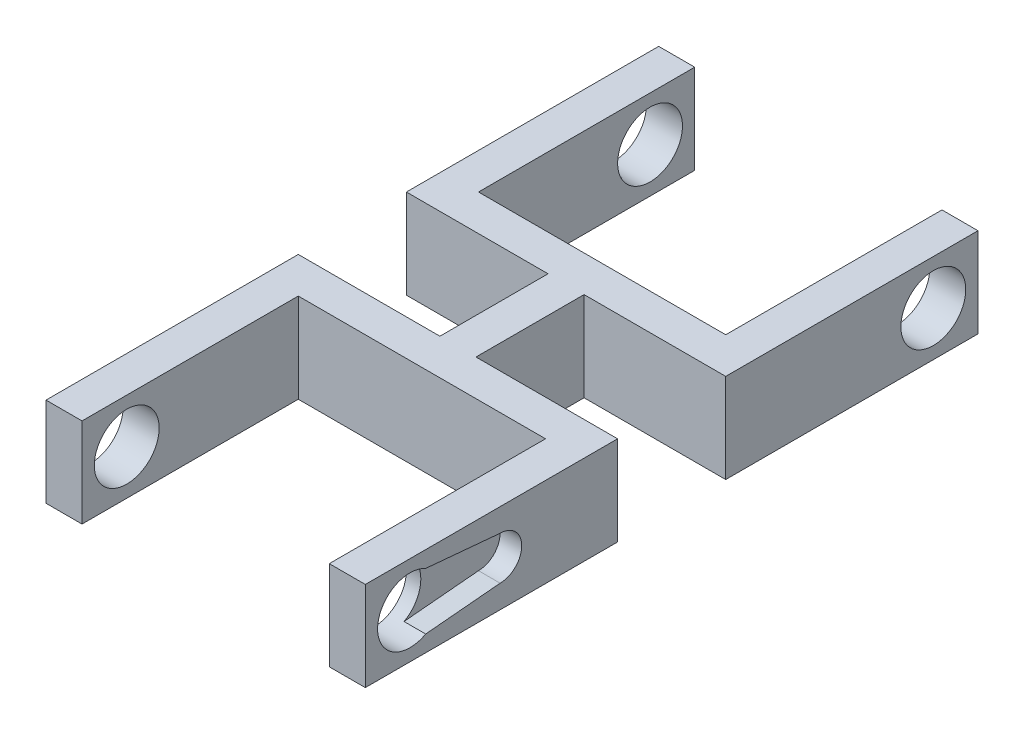
ISO-10303-21;
HEADER;
FILE_DESCRIPTION(('STEP AP214'),'2;1');
FILE_NAME('part.step','',(''),(''),'','','');
FILE_SCHEMA(('AUTOMOTIVE_DESIGN { 1 0 10303 214 1 1 1 1 }'));
ENDSEC;
DATA;
#1=APPLICATION_CONTEXT('core data for automotive mechanical design processes');
#2=APPLICATION_PROTOCOL_DEFINITION('international standard','automotive_design',2000,#1);
#3=PRODUCT_CONTEXT('',#1,'mechanical');
#4=PRODUCT('Part','Part','',(#3));
#5=PRODUCT_RELATED_PRODUCT_CATEGORY('part','',(#4));
#6=PRODUCT_DEFINITION_FORMATION('','',#4);
#7=PRODUCT_DEFINITION_CONTEXT('part definition',#1,'design');
#8=PRODUCT_DEFINITION('design','',#6,#7);
#9=PRODUCT_DEFINITION_SHAPE('','',#8);
#10=(LENGTH_UNIT() NAMED_UNIT(*) SI_UNIT(.MILLI.,.METRE.));
#11=(NAMED_UNIT(*) PLANE_ANGLE_UNIT() SI_UNIT($,.RADIAN.));
#12=(NAMED_UNIT(*) SI_UNIT($,.STERADIAN.) SOLID_ANGLE_UNIT());
#13=UNCERTAINTY_MEASURE_WITH_UNIT(LENGTH_MEASURE(1.E-05),#10,'distance_accuracy_value','');
#14=(GEOMETRIC_REPRESENTATION_CONTEXT(3) GLOBAL_UNCERTAINTY_ASSIGNED_CONTEXT((#13)) GLOBAL_UNIT_ASSIGNED_CONTEXT((#10,
#11,#12)) REPRESENTATION_CONTEXT('',''));
#15=CARTESIAN_POINT('',(0.,0.,0.));
#16=DIRECTION('',(0.,0.,1.));
#17=DIRECTION('',(1.,0.,0.));
#18=AXIS2_PLACEMENT_3D('',#15,#16,#17);
#19=CARTESIAN_POINT('',(0.,0.,-20.));
#20=DIRECTION('',(0.,0.,1.));
#21=DIRECTION('',(1.,0.,0.));
#22=AXIS2_PLACEMENT_3D('',#19,#20,#21);
#23=PLANE('',#22);
#24=DIRECTION('',(0.,-1.,0.));
#25=VECTOR('',#24,1.);
#26=CARTESIAN_POINT('',(-17.15,6.2,-20.));
#27=LINE('',#26,#25);
#28=CARTESIAN_POINT('',(-17.15,6.2,-20.));
#29=VERTEX_POINT('',#28);
#30=CARTESIAN_POINT('',(-17.15,-6.2,-20.));
#31=VERTEX_POINT('',#30);
#32=EDGE_CURVE('E355',#29,#31,#27,.T.);
#33=ORIENTED_EDGE('',*,*,#32,.F.);
#34=DIRECTION('',(1.,0.,0.));
#35=VECTOR('',#34,1.);
#36=CARTESIAN_POINT('',(22.15,6.2,-20.));
#37=LINE('',#36,#35);
#38=CARTESIAN_POINT('',(17.15,6.2,-20.));
#39=VERTEX_POINT('',#38);
#40=EDGE_CURVE('E408',#29,#39,#37,.T.);
#41=ORIENTED_EDGE('',*,*,#40,.T.);
#42=DIRECTION('',(0.,1.,0.));
#43=VECTOR('',#42,1.);
#44=CARTESIAN_POINT('',(17.15,6.2,-20.));
#45=LINE('',#44,#43);
#46=CARTESIAN_POINT('',(17.15,-6.2,-20.));
#47=VERTEX_POINT('',#46);
#48=EDGE_CURVE('E381',#47,#39,#45,.T.);
#49=ORIENTED_EDGE('',*,*,#48,.F.);
#50=DIRECTION('',(-1.,0.,0.));
#51=VECTOR('',#50,1.);
#52=CARTESIAN_POINT('',(22.15,-6.2,-20.));
#53=LINE('',#52,#51);
#54=EDGE_CURVE('E411',#47,#31,#53,.T.);
#55=ORIENTED_EDGE('',*,*,#54,.T.);
#56=EDGE_LOOP('',(#33,#41,#49,#55));
#57=FACE_BOUND('',#56,.T.);
#58=ADVANCED_FACE('F41',(#57),#23,.F.);
#59=CARTESIAN_POINT('',(0.,0.,0.));
#60=DIRECTION('',(0.,0.,1.));
#61=DIRECTION('',(1.,0.,0.));
#62=AXIS2_PLACEMENT_3D('',#59,#60,#61);
#63=PLANE('',#62);
#64=DIRECTION('',(-1.,0.,0.));
#65=VECTOR('',#64,1.);
#66=CARTESIAN_POINT('',(-22.15,6.2,0.));
#67=LINE('',#66,#65);
#68=CARTESIAN_POINT('',(-2.5,6.2,0.));
#69=VERTEX_POINT('',#68);
#70=CARTESIAN_POINT('',(-22.15,6.2,0.));
#71=VERTEX_POINT('',#70);
#72=EDGE_CURVE('E521',#69,#71,#67,.T.);
#73=ORIENTED_EDGE('',*,*,#72,.F.);
#74=DIRECTION('',(0.,1.,0.));
#75=VECTOR('',#74,1.);
#76=CARTESIAN_POINT('',(-2.5,-6.2,0.));
#77=LINE('',#76,#75);
#78=CARTESIAN_POINT('',(-2.5,-6.2,0.));
#79=VERTEX_POINT('',#78);
#80=EDGE_CURVE('E322',#79,#69,#77,.T.);
#81=ORIENTED_EDGE('',*,*,#80,.F.);
#82=DIRECTION('',(1.,0.,0.));
#83=VECTOR('',#82,1.);
#84=CARTESIAN_POINT('',(-22.15,-6.2,0.));
#85=LINE('',#84,#83);
#86=CARTESIAN_POINT('',(-22.15,-6.2,0.));
#87=VERTEX_POINT('',#86);
#88=EDGE_CURVE('E514',#87,#79,#85,.T.);
#89=ORIENTED_EDGE('',*,*,#88,.F.);
#90=DIRECTION('',(0.,-1.,0.));
#91=VECTOR('',#90,1.);
#92=CARTESIAN_POINT('',(-22.15,6.2,0.));
#93=LINE('',#92,#91);
#94=EDGE_CURVE('E525',#71,#87,#93,.T.);
#95=ORIENTED_EDGE('',*,*,#94,.F.);
#96=EDGE_LOOP('',(#73,#81,#89,#95));
#97=FACE_BOUND('',#96,.T.);
#98=ADVANCED_FACE('F569',(#97),#63,.F.);
#99=CARTESIAN_POINT('',(2.49999999999999,-6.2,0.));
#100=VERTEX_POINT('',#99);
#101=CARTESIAN_POINT('',(22.15,-6.2,0.));
#102=VERTEX_POINT('',#101);
#103=EDGE_CURVE('E528',#100,#102,#85,.T.);
#104=ORIENTED_EDGE('',*,*,#103,.F.);
#105=DIRECTION('',(0.,1.,0.));
#106=VECTOR('',#105,1.);
#107=CARTESIAN_POINT('',(2.49999999999999,-6.2,0.));
#108=LINE('',#107,#106);
#109=CARTESIAN_POINT('',(2.49999999999999,6.2,0.));
#110=VERTEX_POINT('',#109);
#111=EDGE_CURVE('E334',#100,#110,#108,.T.);
#112=ORIENTED_EDGE('',*,*,#111,.T.);
#113=CARTESIAN_POINT('',(22.15,6.2,0.));
#114=VERTEX_POINT('',#113);
#115=EDGE_CURVE('E522',#114,#110,#67,.T.);
#116=ORIENTED_EDGE('',*,*,#115,.F.);
#117=DIRECTION('',(0.,1.,0.));
#118=VECTOR('',#117,1.);
#119=CARTESIAN_POINT('',(22.15,6.2,0.));
#120=LINE('',#119,#118);
#121=EDGE_CURVE('E509',#102,#114,#120,.T.);
#122=ORIENTED_EDGE('',*,*,#121,.F.);
#123=EDGE_LOOP('',(#104,#112,#116,#122));
#124=FACE_BOUND('',#123,.T.);
#125=ADVANCED_FACE('F618',(#124),#63,.F.);
#126=CARTESIAN_POINT('',(0.,0.,5.));
#127=DIRECTION('',(0.,0.,1.));
#128=DIRECTION('',(1.,0.,0.));
#129=AXIS2_PLACEMENT_3D('',#126,#127,#128);
#130=PLANE('',#129);
#131=DIRECTION('',(-1.,0.,0.));
#132=VECTOR('',#131,1.);
#133=CARTESIAN_POINT('',(-22.15,6.2,5.));
#134=LINE('',#133,#132);
#135=CARTESIAN_POINT('',(17.15,6.2,5.));
#136=VERTEX_POINT('',#135);
#137=CARTESIAN_POINT('',(-17.15,6.2,5.));
#138=VERTEX_POINT('',#137);
#139=EDGE_CURVE('E510',#136,#138,#134,.T.);
#140=ORIENTED_EDGE('',*,*,#139,.T.);
#141=DIRECTION('',(0.,1.,0.));
#142=VECTOR('',#141,1.);
#143=CARTESIAN_POINT('',(-17.15,6.2,5.));
#144=LINE('',#143,#142);
#145=CARTESIAN_POINT('',(-17.15,-6.2,5.));
#146=VERTEX_POINT('',#145);
#147=EDGE_CURVE('E457',#146,#138,#144,.T.);
#148=ORIENTED_EDGE('',*,*,#147,.F.);
#149=DIRECTION('',(1.,0.,0.));
#150=VECTOR('',#149,1.);
#151=CARTESIAN_POINT('',(-22.15,-6.2,5.));
#152=LINE('',#151,#150);
#153=CARTESIAN_POINT('',(17.15,-6.2,5.));
#154=VERTEX_POINT('',#153);
#155=EDGE_CURVE('E513',#146,#154,#152,.T.);
#156=ORIENTED_EDGE('',*,*,#155,.T.);
#157=DIRECTION('',(0.,-1.,0.));
#158=VECTOR('',#157,1.);
#159=CARTESIAN_POINT('',(17.15,6.2,5.));
#160=LINE('',#159,#158);
#161=EDGE_CURVE('E483',#136,#154,#160,.T.);
#162=ORIENTED_EDGE('',*,*,#161,.F.);
#163=EDGE_LOOP('',(#140,#148,#156,#162));
#164=FACE_BOUND('',#163,.T.);
#165=ADVANCED_FACE('F640',(#164),#130,.T.);
#166=CARTESIAN_POINT('',(22.15,6.2,5.));
#167=DIRECTION('',(-1.,0.,0.));
#168=DIRECTION('',(0.,0.,1.));
#169=AXIS2_PLACEMENT_3D('',#166,#167,#168);
#170=PLANE('',#169);
#171=CARTESIAN_POINT('',(22.15,0.,16.3));
#172=DIRECTION('',(1.,0.,0.));
#173=DIRECTION('',(0.,0.,-1.));
#174=AXIS2_PLACEMENT_3D('',#171,#172,#173);
#175=CIRCLE('',#174,3.);
#176=CARTESIAN_POINT('',(22.15,-3.,16.3));
#177=VERTEX_POINT('',#176);
#178=CARTESIAN_POINT('',(22.15,3.,16.3));
#179=VERTEX_POINT('',#178);
#180=EDGE_CURVE('E236',#177,#179,#175,.T.);
#181=ORIENTED_EDGE('',*,*,#180,.F.);
#182=DIRECTION('',(0.,0.0907148130543785,-0.995876911416521));
#183=VECTOR('',#182,1.);
#184=CARTESIAN_POINT('',(22.15,-3.94071478051588,26.6272673844617));
#185=LINE('',#184,#183);
#186=CARTESIAN_POINT('',(22.15,-3.94071478051588,26.6272673844617));
#187=VERTEX_POINT('',#186);
#188=EDGE_CURVE('E252',#187,#177,#185,.T.);
#189=ORIENTED_EDGE('',*,*,#188,.F.);
#190=CARTESIAN_POINT('',(22.15,0.,28.8));
#191=DIRECTION('',(1.,0.,0.));
#192=DIRECTION('',(0.,0.,-1.));
#193=AXIS2_PLACEMENT_3D('',#190,#191,#192);
#194=CIRCLE('',#193,4.5);
#195=CARTESIAN_POINT('',(22.15,3.94071478051588,26.6272673844617));
#196=VERTEX_POINT('',#195);
#197=EDGE_CURVE('E444',#196,#187,#194,.T.);
#198=ORIENTED_EDGE('',*,*,#197,.F.);
#199=DIRECTION('',(0.,0.0907148130543785,0.995876911416521));
#200=VECTOR('',#199,1.);
#201=CARTESIAN_POINT('',(22.15,3.,16.3));
#202=LINE('',#201,#200);
#203=EDGE_CURVE('E256',#179,#196,#202,.T.);
#204=ORIENTED_EDGE('',*,*,#203,.F.);
#205=EDGE_LOOP('',(#181,#189,#198,#204));
#206=FACE_BOUND('',#205,.T.);
#207=ORIENTED_EDGE('',*,*,#121,.T.);
#208=DIRECTION('',(0.,0.,-1.));
#209=VECTOR('',#208,1.);
#210=CARTESIAN_POINT('',(22.15,6.2,5.));
#211=LINE('',#210,#209);
#212=CARTESIAN_POINT('',(22.15,6.2,35.));
#213=VERTEX_POINT('',#212);
#214=EDGE_CURVE('E11',#213,#114,#211,.T.);
#215=ORIENTED_EDGE('',*,*,#214,.F.);
#216=DIRECTION('',(0.,1.,0.));
#217=VECTOR('',#216,1.);
#218=CARTESIAN_POINT('',(22.15,6.2,35.));
#219=LINE('',#218,#217);
#220=CARTESIAN_POINT('',(22.15,-6.2,35.));
#221=VERTEX_POINT('',#220);
#222=EDGE_CURVE('E484',#221,#213,#219,.T.);
#223=ORIENTED_EDGE('',*,*,#222,.F.);
#224=DIRECTION('',(0.,0.,-1.));
#225=VECTOR('',#224,1.);
#226=CARTESIAN_POINT('',(22.15,-6.2,5.));
#227=LINE('',#226,#225);
#228=EDGE_CURVE('E517',#221,#102,#227,.T.);
#229=ORIENTED_EDGE('',*,*,#228,.T.);
#230=EDGE_LOOP('',(#207,#215,#223,#229));
#231=FACE_BOUND('',#230,.T.);
#232=ADVANCED_FACE('F43',(#206,#231),#170,.F.);
#233=CARTESIAN_POINT('',(-22.15,6.2,5.));
#234=DIRECTION('',(0.,-1.,0.));
#235=DIRECTION('',(0.,0.,-1.));
#236=AXIS2_PLACEMENT_3D('',#233,#234,#235);
#237=PLANE('',#236);
#238=DIRECTION('',(0.,0.,-1.));
#239=VECTOR('',#238,1.);
#240=CARTESIAN_POINT('',(-2.5,6.2,-15.));
#241=LINE('',#240,#239);
#242=CARTESIAN_POINT('',(-2.5,6.2,-15.));
#243=VERTEX_POINT('',#242);
#244=EDGE_CURVE('E317',#69,#243,#241,.T.);
#245=ORIENTED_EDGE('',*,*,#244,.F.);
#246=ORIENTED_EDGE('',*,*,#72,.T.);
#247=DIRECTION('',(0.,0.,-1.));
#248=VECTOR('',#247,1.);
#249=CARTESIAN_POINT('',(-22.15,6.2,5.));
#250=LINE('',#249,#248);
#251=CARTESIAN_POINT('',(-22.15,6.2,35.));
#252=VERTEX_POINT('',#251);
#253=EDGE_CURVE('E51',#252,#71,#250,.T.);
#254=ORIENTED_EDGE('',*,*,#253,.F.);
#255=DIRECTION('',(-1.,0.,0.));
#256=VECTOR('',#255,1.);
#257=CARTESIAN_POINT('',(-22.15,6.2,35.));
#258=LINE('',#257,#256);
#259=CARTESIAN_POINT('',(-17.15,6.2,35.));
#260=VERTEX_POINT('',#259);
#261=EDGE_CURVE('E468',#260,#252,#258,.T.);
#262=ORIENTED_EDGE('',*,*,#261,.F.);
#263=DIRECTION('',(0.,0.,-1.));
#264=VECTOR('',#263,1.);
#265=CARTESIAN_POINT('',(-17.15,6.2,35.));
#266=LINE('',#265,#264);
#267=EDGE_CURVE('E472',#260,#138,#266,.T.);
#268=ORIENTED_EDGE('',*,*,#267,.T.);
#269=ORIENTED_EDGE('',*,*,#139,.F.);
#270=DIRECTION('',(0.,0.,-1.));
#271=VECTOR('',#270,1.);
#272=CARTESIAN_POINT('',(17.15,6.2,35.));
#273=LINE('',#272,#271);
#274=CARTESIAN_POINT('',(17.15,6.2,35.));
#275=VERTEX_POINT('',#274);
#276=EDGE_CURVE('E505',#275,#136,#273,.T.);
#277=ORIENTED_EDGE('',*,*,#276,.F.);
#278=DIRECTION('',(-1.,0.,0.));
#279=VECTOR('',#278,1.);
#280=CARTESIAN_POINT('',(22.15,6.2,35.));
#281=LINE('',#280,#279);
#282=EDGE_CURVE('E488',#213,#275,#281,.T.);
#283=ORIENTED_EDGE('',*,*,#282,.F.);
#284=ORIENTED_EDGE('',*,*,#214,.T.);
#285=ORIENTED_EDGE('',*,*,#115,.T.);
#286=DIRECTION('',(0.,0.,1.));
#287=VECTOR('',#286,1.);
#288=CARTESIAN_POINT('',(2.49999999999999,6.2,-15.));
#289=LINE('',#288,#287);
#290=CARTESIAN_POINT('',(2.49999999999999,6.2,-15.));
#291=VERTEX_POINT('',#290);
#292=EDGE_CURVE('E302',#291,#110,#289,.T.);
#293=ORIENTED_EDGE('',*,*,#292,.F.);
#294=DIRECTION('',(1.,0.,0.));
#295=VECTOR('',#294,1.);
#296=CARTESIAN_POINT('',(22.15,6.2,-15.));
#297=LINE('',#296,#295);
#298=CARTESIAN_POINT('',(22.15,6.2,-15.));
#299=VERTEX_POINT('',#298);
#300=EDGE_CURVE('E419',#291,#299,#297,.T.);
#301=ORIENTED_EDGE('',*,*,#300,.T.);
#302=DIRECTION('',(0.,0.,1.));
#303=VECTOR('',#302,1.);
#304=CARTESIAN_POINT('',(22.15,6.2,-20.));
#305=LINE('',#304,#303);
#306=CARTESIAN_POINT('',(22.15,6.2,-50.));
#307=VERTEX_POINT('',#306);
#308=EDGE_CURVE('E436',#307,#299,#305,.T.);
#309=ORIENTED_EDGE('',*,*,#308,.F.);
#310=DIRECTION('',(1.,0.,0.));
#311=VECTOR('',#310,1.);
#312=CARTESIAN_POINT('',(22.15,6.2,-50.));
#313=LINE('',#312,#311);
#314=CARTESIAN_POINT('',(17.15,6.2,-50.));
#315=VERTEX_POINT('',#314);
#316=EDGE_CURVE('E392',#315,#307,#313,.T.);
#317=ORIENTED_EDGE('',*,*,#316,.F.);
#318=DIRECTION('',(0.,0.,1.));
#319=VECTOR('',#318,1.);
#320=CARTESIAN_POINT('',(17.15,6.2,-50.));
#321=LINE('',#320,#319);
#322=EDGE_CURVE('E396',#315,#39,#321,.T.);
#323=ORIENTED_EDGE('',*,*,#322,.T.);
#324=ORIENTED_EDGE('',*,*,#40,.F.);
#325=DIRECTION('',(0.,0.,1.));
#326=VECTOR('',#325,1.);
#327=CARTESIAN_POINT('',(-17.15,6.2,-50.));
#328=LINE('',#327,#326);
#329=CARTESIAN_POINT('',(-17.15,6.2,-50.));
#330=VERTEX_POINT('',#329);
#331=EDGE_CURVE('E377',#330,#29,#328,.T.);
#332=ORIENTED_EDGE('',*,*,#331,.F.);
#333=DIRECTION('',(1.,0.,0.));
#334=VECTOR('',#333,1.);
#335=CARTESIAN_POINT('',(-22.15,6.2,-50.));
#336=LINE('',#335,#334);
#337=CARTESIAN_POINT('',(-22.15,6.2,-50.));
#338=VERTEX_POINT('',#337);
#339=EDGE_CURVE('E360',#338,#330,#336,.T.);
#340=ORIENTED_EDGE('',*,*,#339,.F.);
#341=DIRECTION('',(0.,0.,1.));
#342=VECTOR('',#341,1.);
#343=CARTESIAN_POINT('',(-22.15,6.2,-20.));
#344=LINE('',#343,#342);
#345=CARTESIAN_POINT('',(-22.15,6.2,-15.));
#346=VERTEX_POINT('',#345);
#347=EDGE_CURVE('E440',#338,#346,#344,.T.);
#348=ORIENTED_EDGE('',*,*,#347,.T.);
#349=EDGE_CURVE('E420',#346,#243,#297,.T.);
#350=ORIENTED_EDGE('',*,*,#349,.T.);
#351=EDGE_LOOP('',(#245,#246,#254,#262,#268,#269,#277,#283,#284,#285,#293,#301,#309,#317,#323,
#324,#332,#340,#348,#350));
#352=FACE_BOUND('',#351,.T.);
#353=ADVANCED_FACE('F559',(#352),#237,.F.);
#354=CARTESIAN_POINT('',(-22.15,6.2,5.));
#355=DIRECTION('',(1.,0.,0.));
#356=DIRECTION('',(0.,1.,0.));
#357=AXIS2_PLACEMENT_3D('',#354,#355,#356);
#358=PLANE('',#357);
#359=CARTESIAN_POINT('',(-22.15,0.,28.8));
#360=DIRECTION('',(1.,0.,0.));
#361=DIRECTION('',(0.,1.,0.));
#362=AXIS2_PLACEMENT_3D('',#359,#360,#361);
#363=CIRCLE('',#362,4.5);
#364=CARTESIAN_POINT('',(-22.15,4.5,28.8));
#365=VERTEX_POINT('',#364);
#366=EDGE_CURVE('E453',#365,#365,#363,.T.);
#367=ORIENTED_EDGE('',*,*,#366,.T.);
#368=EDGE_LOOP('',(#367));
#369=FACE_BOUND('',#368,.T.);
#370=ORIENTED_EDGE('',*,*,#94,.T.);
#371=DIRECTION('',(0.,0.,-1.));
#372=VECTOR('',#371,1.);
#373=CARTESIAN_POINT('',(-22.15,-6.2,5.));
#374=LINE('',#373,#372);
#375=CARTESIAN_POINT('',(-22.15,-6.2,35.));
#376=VERTEX_POINT('',#375);
#377=EDGE_CURVE('E534',#376,#87,#374,.T.);
#378=ORIENTED_EDGE('',*,*,#377,.F.);
#379=DIRECTION('',(0.,-1.,0.));
#380=VECTOR('',#379,1.);
#381=CARTESIAN_POINT('',(-22.15,6.2,35.));
#382=LINE('',#381,#380);
#383=EDGE_CURVE('E458',#252,#376,#382,.T.);
#384=ORIENTED_EDGE('',*,*,#383,.F.);
#385=ORIENTED_EDGE('',*,*,#253,.T.);
#386=EDGE_LOOP('',(#370,#378,#384,#385));
#387=FACE_BOUND('',#386,.T.);
#388=ADVANCED_FACE('F555',(#369,#387),#358,.F.);
#389=CARTESIAN_POINT('',(-22.15,-6.2,5.));
#390=DIRECTION('',(0.,1.,0.));
#391=DIRECTION('',(0.,0.,1.));
#392=AXIS2_PLACEMENT_3D('',#389,#390,#391);
#393=PLANE('',#392);
#394=ORIENTED_EDGE('',*,*,#88,.T.);
#395=DIRECTION('',(0.,0.,-1.));
#396=VECTOR('',#395,1.);
#397=CARTESIAN_POINT('',(-2.5,-6.2,-15.));
#398=LINE('',#397,#396);
#399=CARTESIAN_POINT('',(-2.5,-6.2,-15.));
#400=VERTEX_POINT('',#399);
#401=EDGE_CURVE('E312',#79,#400,#398,.T.);
#402=ORIENTED_EDGE('',*,*,#401,.T.);
#403=DIRECTION('',(-1.,0.,0.));
#404=VECTOR('',#403,1.);
#405=CARTESIAN_POINT('',(22.15,-6.2,-15.));
#406=LINE('',#405,#404);
#407=CARTESIAN_POINT('',(-22.15,-6.2,-15.));
#408=VERTEX_POINT('',#407);
#409=EDGE_CURVE('E426',#400,#408,#406,.T.);
#410=ORIENTED_EDGE('',*,*,#409,.T.);
#411=DIRECTION('',(0.,0.,1.));
#412=VECTOR('',#411,1.);
#413=CARTESIAN_POINT('',(-22.15,-6.2,-20.));
#414=LINE('',#413,#412);
#415=CARTESIAN_POINT('',(-22.15,-6.2,-50.));
#416=VERTEX_POINT('',#415);
#417=EDGE_CURVE('E415',#416,#408,#414,.T.);
#418=ORIENTED_EDGE('',*,*,#417,.F.);
#419=DIRECTION('',(-1.,0.,0.));
#420=VECTOR('',#419,1.);
#421=CARTESIAN_POINT('',(-22.15,-6.2,-50.));
#422=LINE('',#421,#420);
#423=CARTESIAN_POINT('',(-17.15,-6.2,-50.));
#424=VERTEX_POINT('',#423);
#425=EDGE_CURVE('E366',#424,#416,#422,.T.);
#426=ORIENTED_EDGE('',*,*,#425,.F.);
#427=DIRECTION('',(0.,0.,1.));
#428=VECTOR('',#427,1.);
#429=CARTESIAN_POINT('',(-17.15,-6.2,-50.));
#430=LINE('',#429,#428);
#431=EDGE_CURVE('E370',#424,#31,#430,.T.);
#432=ORIENTED_EDGE('',*,*,#431,.T.);
#433=ORIENTED_EDGE('',*,*,#54,.F.);
#434=DIRECTION('',(0.,0.,1.));
#435=VECTOR('',#434,1.);
#436=CARTESIAN_POINT('',(17.15,-6.2,-50.));
#437=LINE('',#436,#435);
#438=CARTESIAN_POINT('',(17.15,-6.2,-50.));
#439=VERTEX_POINT('',#438);
#440=EDGE_CURVE('E403',#439,#47,#437,.T.);
#441=ORIENTED_EDGE('',*,*,#440,.F.);
#442=DIRECTION('',(-1.,0.,0.));
#443=VECTOR('',#442,1.);
#444=CARTESIAN_POINT('',(22.15,-6.2,-50.));
#445=LINE('',#444,#443);
#446=CARTESIAN_POINT('',(22.15,-6.2,-50.));
#447=VERTEX_POINT('',#446);
#448=EDGE_CURVE('E386',#447,#439,#445,.T.);
#449=ORIENTED_EDGE('',*,*,#448,.F.);
#450=DIRECTION('',(0.,0.,1.));
#451=VECTOR('',#450,1.);
#452=CARTESIAN_POINT('',(22.15,-6.2,-20.));
#453=LINE('',#452,#451);
#454=CARTESIAN_POINT('',(22.15,-6.2,-15.));
#455=VERTEX_POINT('',#454);
#456=EDGE_CURVE('E432',#447,#455,#453,.T.);
#457=ORIENTED_EDGE('',*,*,#456,.T.);
#458=CARTESIAN_POINT('',(2.49999999999999,-6.2,-15.));
#459=VERTEX_POINT('',#458);
#460=EDGE_CURVE('E412',#455,#459,#406,.T.);
#461=ORIENTED_EDGE('',*,*,#460,.T.);
#462=DIRECTION('',(0.,0.,1.));
#463=VECTOR('',#462,1.);
#464=CARTESIAN_POINT('',(2.49999999999999,-6.2,-15.));
#465=LINE('',#464,#463);
#466=EDGE_CURVE('E330',#459,#100,#465,.T.);
#467=ORIENTED_EDGE('',*,*,#466,.T.);
#468=ORIENTED_EDGE('',*,*,#103,.T.);
#469=ORIENTED_EDGE('',*,*,#228,.F.);
#470=DIRECTION('',(1.,0.,0.));
#471=VECTOR('',#470,1.);
#472=CARTESIAN_POINT('',(22.15,-6.2,35.));
#473=LINE('',#472,#471);
#474=CARTESIAN_POINT('',(17.15,-6.2,35.));
#475=VERTEX_POINT('',#474);
#476=EDGE_CURVE('E494',#475,#221,#473,.T.);
#477=ORIENTED_EDGE('',*,*,#476,.F.);
#478=DIRECTION('',(0.,0.,-1.));
#479=VECTOR('',#478,1.);
#480=CARTESIAN_POINT('',(17.15,-6.2,35.));
#481=LINE('',#480,#479);
#482=EDGE_CURVE('E498',#475,#154,#481,.T.);
#483=ORIENTED_EDGE('',*,*,#482,.T.);
#484=ORIENTED_EDGE('',*,*,#155,.F.);
#485=DIRECTION('',(0.,0.,-1.));
#486=VECTOR('',#485,1.);
#487=CARTESIAN_POINT('',(-17.15,-6.2,35.));
#488=LINE('',#487,#486);
#489=CARTESIAN_POINT('',(-17.15,-6.2,35.));
#490=VERTEX_POINT('',#489);
#491=EDGE_CURVE('E479',#490,#146,#488,.T.);
#492=ORIENTED_EDGE('',*,*,#491,.F.);
#493=DIRECTION('',(1.,0.,0.));
#494=VECTOR('',#493,1.);
#495=CARTESIAN_POINT('',(-22.15,-6.2,35.));
#496=LINE('',#495,#494);
#497=EDGE_CURVE('E462',#376,#490,#496,.T.);
#498=ORIENTED_EDGE('',*,*,#497,.F.);
#499=ORIENTED_EDGE('',*,*,#377,.T.);
#500=EDGE_LOOP('',(#394,#402,#410,#418,#426,#432,#433,#441,#449,#457,#461,#467,#468,#469,#477,
#483,#484,#492,#498,#499));
#501=FACE_BOUND('',#500,.T.);
#502=ADVANCED_FACE('F558',(#501),#393,.F.);
#503=CARTESIAN_POINT('',(17.15,6.2,35.));
#504=DIRECTION('',(1.,0.,0.));
#505=DIRECTION('',(0.,0.,-1.));
#506=AXIS2_PLACEMENT_3D('',#503,#504,#505);
#507=PLANE('',#506);
#508=CARTESIAN_POINT('',(17.15,0.,28.8));
#509=DIRECTION('',(1.,0.,0.));
#510=DIRECTION('',(0.,0.,-1.));
#511=AXIS2_PLACEMENT_3D('',#508,#509,#510);
#512=CIRCLE('',#511,4.5);
#513=CARTESIAN_POINT('',(17.15,0.,24.3));
#514=VERTEX_POINT('',#513);
#515=EDGE_CURVE('E449',#514,#514,#512,.T.);
#516=ORIENTED_EDGE('',*,*,#515,.T.);
#517=EDGE_LOOP('',(#516));
#518=FACE_BOUND('',#517,.T.);
#519=ORIENTED_EDGE('',*,*,#161,.T.);
#520=ORIENTED_EDGE('',*,*,#482,.F.);
#521=DIRECTION('',(0.,-1.,0.));
#522=VECTOR('',#521,1.);
#523=CARTESIAN_POINT('',(17.15,6.2,35.));
#524=LINE('',#523,#522);
#525=EDGE_CURVE('E491',#275,#475,#524,.T.);
#526=ORIENTED_EDGE('',*,*,#525,.F.);
#527=ORIENTED_EDGE('',*,*,#276,.T.);
#528=EDGE_LOOP('',(#519,#520,#526,#527));
#529=FACE_BOUND('',#528,.T.);
#530=ADVANCED_FACE('F632',(#518,#529),#507,.F.);
#531=CARTESIAN_POINT('',(0.,0.,35.));
#532=DIRECTION('',(0.,0.,-1.));
#533=DIRECTION('',(-1.,0.,0.));
#534=AXIS2_PLACEMENT_3D('',#531,#532,#533);
#535=PLANE('',#534);
#536=ORIENTED_EDGE('',*,*,#222,.T.);
#537=ORIENTED_EDGE('',*,*,#282,.T.);
#538=ORIENTED_EDGE('',*,*,#525,.T.);
#539=ORIENTED_EDGE('',*,*,#476,.T.);
#540=EDGE_LOOP('',(#536,#537,#538,#539));
#541=FACE_BOUND('',#540,.T.);
#542=ADVANCED_FACE('F636',(#541),#535,.F.);
#543=CARTESIAN_POINT('',(-17.15,6.2,35.));
#544=DIRECTION('',(-1.,0.,0.));
#545=DIRECTION('',(0.,0.,1.));
#546=AXIS2_PLACEMENT_3D('',#543,#544,#545);
#547=PLANE('',#546);
#548=CARTESIAN_POINT('',(-17.15,0.,28.8));
#549=DIRECTION('',(-1.,0.,0.));
#550=DIRECTION('',(0.,0.,1.));
#551=AXIS2_PLACEMENT_3D('',#548,#549,#550);
#552=CIRCLE('',#551,4.5);
#553=CARTESIAN_POINT('',(-17.15,0.,33.3));
#554=VERTEX_POINT('',#553);
#555=EDGE_CURVE('E448',#554,#554,#552,.T.);
#556=ORIENTED_EDGE('',*,*,#555,.T.);
#557=EDGE_LOOP('',(#556));
#558=FACE_BOUND('',#557,.T.);
#559=ORIENTED_EDGE('',*,*,#147,.T.);
#560=ORIENTED_EDGE('',*,*,#267,.F.);
#561=DIRECTION('',(0.,1.,0.));
#562=VECTOR('',#561,1.);
#563=CARTESIAN_POINT('',(-17.15,6.2,35.));
#564=LINE('',#563,#562);
#565=EDGE_CURVE('E465',#490,#260,#564,.T.);
#566=ORIENTED_EDGE('',*,*,#565,.F.);
#567=ORIENTED_EDGE('',*,*,#491,.T.);
#568=EDGE_LOOP('',(#559,#560,#566,#567));
#569=FACE_BOUND('',#568,.T.);
#570=ADVANCED_FACE('F544',(#558,#569),#547,.F.);
#571=CARTESIAN_POINT('',(0.,0.,35.));
#572=DIRECTION('',(0.,0.,1.));
#573=DIRECTION('',(1.,0.,0.));
#574=AXIS2_PLACEMENT_3D('',#571,#572,#573);
#575=PLANE('',#574);
#576=ORIENTED_EDGE('',*,*,#383,.T.);
#577=ORIENTED_EDGE('',*,*,#497,.T.);
#578=ORIENTED_EDGE('',*,*,#565,.T.);
#579=ORIENTED_EDGE('',*,*,#261,.T.);
#580=EDGE_LOOP('',(#576,#577,#578,#579));
#581=FACE_BOUND('',#580,.T.);
#582=ADVANCED_FACE('F551',(#581),#575,.T.);
#583=CARTESIAN_POINT('',(-27.85,0.,28.8));
#584=DIRECTION('',(1.,0.,0.));
#585=DIRECTION('',(0.,0.,-1.));
#586=AXIS2_PLACEMENT_3D('',#583,#584,#585);
#587=CYLINDRICAL_SURFACE('',#586,4.5);
#588=ORIENTED_EDGE('',*,*,#555,.F.);
#589=EDGE_LOOP('',(#588));
#590=FACE_BOUND('',#589,.T.);
#591=ORIENTED_EDGE('',*,*,#366,.F.);
#592=EDGE_LOOP('',(#591));
#593=FACE_BOUND('',#592,.T.);
#594=ADVANCED_FACE('F547',(#590,#593),#587,.F.);
#595=ORIENTED_EDGE('',*,*,#197,.T.);
#596=DIRECTION('',(1.,0.,0.));
#597=VECTOR('',#596,1.);
#598=CARTESIAN_POINT('',(19.15,-3.94071478051588,26.6272673844617));
#599=LINE('',#598,#597);
#600=CARTESIAN_POINT('',(19.15,-3.94071478051588,26.6272673844617));
#601=VERTEX_POINT('',#600);
#602=EDGE_CURVE('E271',#601,#187,#599,.T.);
#603=ORIENTED_EDGE('',*,*,#602,.F.);
#604=CARTESIAN_POINT('',(19.15,0.,28.8));
#605=DIRECTION('',(-1.,0.,0.));
#606=DIRECTION('',(0.,0.,1.));
#607=AXIS2_PLACEMENT_3D('',#604,#605,#606);
#608=CIRCLE('',#607,4.5);
#609=CARTESIAN_POINT('',(19.15,3.94071478051588,26.6272673844617));
#610=VERTEX_POINT('',#609);
#611=EDGE_CURVE('E247',#610,#601,#608,.T.);
#612=ORIENTED_EDGE('',*,*,#611,.F.);
#613=DIRECTION('',(1.,0.,0.));
#614=VECTOR('',#613,1.);
#615=CARTESIAN_POINT('',(19.15,3.94071478051588,26.6272673844617));
#616=LINE('',#615,#614);
#617=EDGE_CURVE('E240',#610,#196,#616,.T.);
#618=ORIENTED_EDGE('',*,*,#617,.T.);
#619=EDGE_LOOP('',(#595,#603,#612,#618));
#620=FACE_BOUND('',#619,.T.);
#621=ORIENTED_EDGE('',*,*,#515,.F.);
#622=EDGE_LOOP('',(#621));
#623=FACE_BOUND('',#622,.T.);
#624=ADVANCED_FACE('F550',(#620,#623),#587,.F.);
#625=CARTESIAN_POINT('',(0.,0.,-15.));
#626=DIRECTION('',(0.,0.,1.));
#627=DIRECTION('',(1.,0.,0.));
#628=AXIS2_PLACEMENT_3D('',#625,#626,#627);
#629=PLANE('',#628);
#630=ORIENTED_EDGE('',*,*,#409,.F.);
#631=DIRECTION('',(0.,1.,0.));
#632=VECTOR('',#631,1.);
#633=CARTESIAN_POINT('',(-2.5,-6.2,-15.));
#634=LINE('',#633,#632);
#635=EDGE_CURVE('E316',#400,#243,#634,.T.);
#636=ORIENTED_EDGE('',*,*,#635,.T.);
#637=ORIENTED_EDGE('',*,*,#349,.F.);
#638=DIRECTION('',(0.,1.,0.));
#639=VECTOR('',#638,1.);
#640=CARTESIAN_POINT('',(-22.15,-6.2,-15.));
#641=LINE('',#640,#639);
#642=EDGE_CURVE('E407',#408,#346,#641,.T.);
#643=ORIENTED_EDGE('',*,*,#642,.F.);
#644=EDGE_LOOP('',(#630,#636,#637,#643));
#645=FACE_BOUND('',#644,.T.);
#646=ADVANCED_FACE('F582',(#645),#629,.T.);
#647=CARTESIAN_POINT('',(-22.15,-6.2,-20.));
#648=DIRECTION('',(1.,0.,0.));
#649=DIRECTION('',(0.,0.,-1.));
#650=AXIS2_PLACEMENT_3D('',#647,#648,#649);
#651=PLANE('',#650);
#652=CARTESIAN_POINT('',(-22.15,0.,-31.3));
#653=DIRECTION('',(-1.,0.,0.));
#654=DIRECTION('',(0.,0.,1.));
#655=AXIS2_PLACEMENT_3D('',#652,#653,#654);
#656=CIRCLE('',#655,2.99999999999999);
#657=CARTESIAN_POINT('',(-22.15,-2.99999999999999,-31.3));
#658=VERTEX_POINT('',#657);
#659=CARTESIAN_POINT('',(-22.15,2.99999999999999,-31.3));
#660=VERTEX_POINT('',#659);
#661=EDGE_CURVE('E270',#658,#660,#656,.T.);
#662=ORIENTED_EDGE('',*,*,#661,.F.);
#663=DIRECTION('',(0.,0.104998471364696,0.994472383231972));
#664=VECTOR('',#663,1.);
#665=CARTESIAN_POINT('',(-22.15,-4.13146733282698,-42.0164704438156));
#666=LINE('',#665,#664);
#667=CARTESIAN_POINT('',(-22.15,-4.13146733282698,-42.0164704438156));
#668=VERTEX_POINT('',#667);
#669=EDGE_CURVE('E279',#668,#658,#666,.T.);
#670=ORIENTED_EDGE('',*,*,#669,.F.);
#671=CARTESIAN_POINT('',(-22.15,0.,-43.8));
#672=DIRECTION('',(-1.,0.,0.));
#673=DIRECTION('',(0.,0.,1.));
#674=AXIS2_PLACEMENT_3D('',#671,#672,#673);
#675=CIRCLE('',#674,4.5);
#676=CARTESIAN_POINT('',(-22.15,4.13146733282699,-42.0164704438156));
#677=VERTEX_POINT('',#676);
#678=EDGE_CURVE('E326',#677,#668,#675,.T.);
#679=ORIENTED_EDGE('',*,*,#678,.F.);
#680=DIRECTION('',(0.,0.104998471364696,-0.994472383231972));
#681=VECTOR('',#680,1.);
#682=CARTESIAN_POINT('',(-22.15,2.99999999999999,-31.3));
#683=LINE('',#682,#681);
#684=EDGE_CURVE('E293',#660,#677,#683,.T.);
#685=ORIENTED_EDGE('',*,*,#684,.F.);
#686=EDGE_LOOP('',(#662,#670,#679,#685));
#687=FACE_BOUND('',#686,.T.);
#688=ORIENTED_EDGE('',*,*,#642,.T.);
#689=ORIENTED_EDGE('',*,*,#347,.F.);
#690=DIRECTION('',(0.,1.,0.));
#691=VECTOR('',#690,1.);
#692=CARTESIAN_POINT('',(-22.15,6.2,-50.));
#693=LINE('',#692,#691);
#694=EDGE_CURVE('E356',#416,#338,#693,.T.);
#695=ORIENTED_EDGE('',*,*,#694,.F.);
#696=ORIENTED_EDGE('',*,*,#417,.T.);
#697=EDGE_LOOP('',(#688,#689,#695,#696));
#698=FACE_BOUND('',#697,.T.);
#699=ADVANCED_FACE('F581',(#687,#698),#651,.F.);
#700=CARTESIAN_POINT('',(22.15,-6.2,-20.));
#701=DIRECTION('',(-1.,0.,0.));
#702=DIRECTION('',(0.,0.,1.));
#703=AXIS2_PLACEMENT_3D('',#700,#701,#702);
#704=PLANE('',#703);
#705=CARTESIAN_POINT('',(22.15,0.,-43.8));
#706=DIRECTION('',(-1.,0.,0.));
#707=DIRECTION('',(0.,0.,1.));
#708=AXIS2_PLACEMENT_3D('',#705,#706,#707);
#709=CIRCLE('',#708,4.5);
#710=CARTESIAN_POINT('',(22.15,0.,-39.3));
#711=VERTEX_POINT('',#710);
#712=EDGE_CURVE('E351',#711,#711,#709,.T.);
#713=ORIENTED_EDGE('',*,*,#712,.T.);
#714=EDGE_LOOP('',(#713));
#715=FACE_BOUND('',#714,.T.);
#716=DIRECTION('',(0.,-1.,0.));
#717=VECTOR('',#716,1.);
#718=CARTESIAN_POINT('',(22.15,-6.2,-15.));
#719=LINE('',#718,#717);
#720=EDGE_CURVE('E423',#299,#455,#719,.T.);
#721=ORIENTED_EDGE('',*,*,#720,.T.);
#722=ORIENTED_EDGE('',*,*,#456,.F.);
#723=DIRECTION('',(0.,-1.,0.));
#724=VECTOR('',#723,1.);
#725=CARTESIAN_POINT('',(22.15,6.2,-50.));
#726=LINE('',#725,#724);
#727=EDGE_CURVE('E382',#307,#447,#726,.T.);
#728=ORIENTED_EDGE('',*,*,#727,.F.);
#729=ORIENTED_EDGE('',*,*,#308,.T.);
#730=EDGE_LOOP('',(#721,#722,#728,#729));
#731=FACE_BOUND('',#730,.T.);
#732=ADVANCED_FACE('F607',(#715,#731),#704,.F.);
#733=ORIENTED_EDGE('',*,*,#300,.F.);
#734=DIRECTION('',(0.,1.,0.));
#735=VECTOR('',#734,1.);
#736=CARTESIAN_POINT('',(2.49999999999999,-6.2,-15.));
#737=LINE('',#736,#735);
#738=EDGE_CURVE('E321',#459,#291,#737,.T.);
#739=ORIENTED_EDGE('',*,*,#738,.F.);
#740=ORIENTED_EDGE('',*,*,#460,.F.);
#741=ORIENTED_EDGE('',*,*,#720,.F.);
#742=EDGE_LOOP('',(#733,#739,#740,#741));
#743=FACE_BOUND('',#742,.T.);
#744=ADVANCED_FACE('F610',(#743),#629,.T.);
#745=CARTESIAN_POINT('',(17.15,6.2,-50.));
#746=DIRECTION('',(1.,0.,0.));
#747=DIRECTION('',(0.,0.,-1.));
#748=AXIS2_PLACEMENT_3D('',#745,#746,#747);
#749=PLANE('',#748);
#750=CARTESIAN_POINT('',(17.15,0.,-43.8));
#751=DIRECTION('',(1.,0.,0.));
#752=DIRECTION('',(0.,0.,-1.));
#753=AXIS2_PLACEMENT_3D('',#750,#751,#752);
#754=CIRCLE('',#753,4.5);
#755=CARTESIAN_POINT('',(17.15,0.,-48.3));
#756=VERTEX_POINT('',#755);
#757=EDGE_CURVE('E347',#756,#756,#754,.T.);
#758=ORIENTED_EDGE('',*,*,#757,.T.);
#759=EDGE_LOOP('',(#758));
#760=FACE_BOUND('',#759,.T.);
#761=ORIENTED_EDGE('',*,*,#48,.T.);
#762=ORIENTED_EDGE('',*,*,#322,.F.);
#763=DIRECTION('',(0.,1.,0.));
#764=VECTOR('',#763,1.);
#765=CARTESIAN_POINT('',(17.15,6.2,-50.));
#766=LINE('',#765,#764);
#767=EDGE_CURVE('E389',#439,#315,#766,.T.);
#768=ORIENTED_EDGE('',*,*,#767,.F.);
#769=ORIENTED_EDGE('',*,*,#440,.T.);
#770=EDGE_LOOP('',(#761,#762,#768,#769));
#771=FACE_BOUND('',#770,.T.);
#772=ADVANCED_FACE('F600',(#760,#771),#749,.F.);
#773=CARTESIAN_POINT('',(0.,0.,-50.));
#774=DIRECTION('',(0.,0.,-1.));
#775=DIRECTION('',(-1.,0.,0.));
#776=AXIS2_PLACEMENT_3D('',#773,#774,#775);
#777=PLANE('',#776);
#778=ORIENTED_EDGE('',*,*,#727,.T.);
#779=ORIENTED_EDGE('',*,*,#448,.T.);
#780=ORIENTED_EDGE('',*,*,#767,.T.);
#781=ORIENTED_EDGE('',*,*,#316,.T.);
#782=EDGE_LOOP('',(#778,#779,#780,#781));
#783=FACE_BOUND('',#782,.T.);
#784=ADVANCED_FACE('F605',(#783),#777,.T.);
#785=CARTESIAN_POINT('',(-17.15,6.2,-50.));
#786=DIRECTION('',(-1.,0.,0.));
#787=DIRECTION('',(0.,0.,1.));
#788=AXIS2_PLACEMENT_3D('',#785,#786,#787);
#789=PLANE('',#788);
#790=CARTESIAN_POINT('',(-17.15,0.,-43.8));
#791=DIRECTION('',(-1.,0.,0.));
#792=DIRECTION('',(0.,0.,1.));
#793=AXIS2_PLACEMENT_3D('',#790,#791,#792);
#794=CIRCLE('',#793,4.5);
#795=CARTESIAN_POINT('',(-17.15,0.,-39.3));
#796=VERTEX_POINT('',#795);
#797=EDGE_CURVE('E45',#796,#796,#794,.T.);
#798=ORIENTED_EDGE('',*,*,#797,.T.);
#799=EDGE_LOOP('',(#798));
#800=FACE_BOUND('',#799,.T.);
#801=ORIENTED_EDGE('',*,*,#32,.T.);
#802=ORIENTED_EDGE('',*,*,#431,.F.);
#803=DIRECTION('',(0.,-1.,0.));
#804=VECTOR('',#803,1.);
#805=CARTESIAN_POINT('',(-17.15,6.2,-50.));
#806=LINE('',#805,#804);
#807=EDGE_CURVE('E363',#330,#424,#806,.T.);
#808=ORIENTED_EDGE('',*,*,#807,.F.);
#809=ORIENTED_EDGE('',*,*,#331,.T.);
#810=EDGE_LOOP('',(#801,#802,#808,#809));
#811=FACE_BOUND('',#810,.T.);
#812=ADVANCED_FACE('F594',(#800,#811),#789,.F.);
#813=CARTESIAN_POINT('',(0.,0.,-50.));
#814=DIRECTION('',(0.,0.,1.));
#815=DIRECTION('',(1.,0.,0.));
#816=AXIS2_PLACEMENT_3D('',#813,#814,#815);
#817=PLANE('',#816);
#818=ORIENTED_EDGE('',*,*,#694,.T.);
#819=ORIENTED_EDGE('',*,*,#339,.T.);
#820=ORIENTED_EDGE('',*,*,#807,.T.);
#821=ORIENTED_EDGE('',*,*,#425,.T.);
#822=EDGE_LOOP('',(#818,#819,#820,#821));
#823=FACE_BOUND('',#822,.T.);
#824=ADVANCED_FACE('F589',(#823),#817,.F.);
#825=CARTESIAN_POINT('',(27.85,0.,-43.8));
#826=DIRECTION('',(-1.,0.,0.));
#827=DIRECTION('',(0.,0.,1.));
#828=AXIS2_PLACEMENT_3D('',#825,#826,#827);
#829=CYLINDRICAL_SURFACE('',#828,4.5);
#830=ORIENTED_EDGE('',*,*,#678,.T.);
#831=DIRECTION('',(-1.,0.,0.));
#832=VECTOR('',#831,1.);
#833=CARTESIAN_POINT('',(-19.15,-4.13146733282698,-42.0164704438156));
#834=LINE('',#833,#832);
#835=CARTESIAN_POINT('',(-19.15,-4.13146733282698,-42.0164704438156));
#836=VERTEX_POINT('',#835);
#837=EDGE_CURVE('E303',#836,#668,#834,.T.);
#838=ORIENTED_EDGE('',*,*,#837,.F.);
#839=CARTESIAN_POINT('',(-19.15,0.,-43.8));
#840=DIRECTION('',(1.,0.,0.));
#841=DIRECTION('',(0.,0.,-1.));
#842=AXIS2_PLACEMENT_3D('',#839,#840,#841);
#843=CIRCLE('',#842,4.5);
#844=CARTESIAN_POINT('',(-19.15,4.13146733282699,-42.0164704438156));
#845=VERTEX_POINT('',#844);
#846=EDGE_CURVE('E282',#845,#836,#843,.T.);
#847=ORIENTED_EDGE('',*,*,#846,.F.);
#848=DIRECTION('',(-1.,0.,0.));
#849=VECTOR('',#848,1.);
#850=CARTESIAN_POINT('',(-19.15,4.13146733282699,-42.0164704438156));
#851=LINE('',#850,#849);
#852=EDGE_CURVE('E306',#845,#677,#851,.T.);
#853=ORIENTED_EDGE('',*,*,#852,.T.);
#854=EDGE_LOOP('',(#830,#838,#847,#853));
#855=FACE_BOUND('',#854,.T.);
#856=ORIENTED_EDGE('',*,*,#797,.F.);
#857=EDGE_LOOP('',(#856));
#858=FACE_BOUND('',#857,.T.);
#859=ADVANCED_FACE('F721',(#855,#858),#829,.F.);
#860=ORIENTED_EDGE('',*,*,#757,.F.);
#861=EDGE_LOOP('',(#860));
#862=FACE_BOUND('',#861,.T.);
#863=ORIENTED_EDGE('',*,*,#712,.F.);
#864=EDGE_LOOP('',(#863));
#865=FACE_BOUND('',#864,.T.);
#866=ADVANCED_FACE('F718',(#862,#865),#829,.F.);
#867=CARTESIAN_POINT('',(2.49999999999999,-6.2,-15.));
#868=DIRECTION('',(-1.,0.,0.));
#869=DIRECTION('',(0.,0.,1.));
#870=AXIS2_PLACEMENT_3D('',#867,#868,#869);
#871=PLANE('',#870);
#872=ORIENTED_EDGE('',*,*,#292,.T.);
#873=ORIENTED_EDGE('',*,*,#111,.F.);
#874=ORIENTED_EDGE('',*,*,#466,.F.);
#875=ORIENTED_EDGE('',*,*,#738,.T.);
#876=EDGE_LOOP('',(#872,#873,#874,#875));
#877=FACE_BOUND('',#876,.T.);
#878=ADVANCED_FACE('F615',(#877),#871,.F.);
#879=CARTESIAN_POINT('',(-2.5,-6.2,-15.));
#880=DIRECTION('',(1.,0.,0.));
#881=DIRECTION('',(0.,0.,-1.));
#882=AXIS2_PLACEMENT_3D('',#879,#880,#881);
#883=PLANE('',#882);
#884=ORIENTED_EDGE('',*,*,#244,.T.);
#885=ORIENTED_EDGE('',*,*,#635,.F.);
#886=ORIENTED_EDGE('',*,*,#401,.F.);
#887=ORIENTED_EDGE('',*,*,#80,.T.);
#888=EDGE_LOOP('',(#884,#885,#886,#887));
#889=FACE_BOUND('',#888,.T.);
#890=ADVANCED_FACE('F574',(#889),#883,.F.);
#891=CARTESIAN_POINT('',(-19.15,0.,-31.3));
#892=DIRECTION('',(-1.,0.,0.));
#893=DIRECTION('',(0.,0.,1.));
#894=AXIS2_PLACEMENT_3D('',#891,#892,#893);
#895=CYLINDRICAL_SURFACE('',#894,2.99999999999999);
#896=ORIENTED_EDGE('',*,*,#661,.T.);
#897=DIRECTION('',(-1.,0.,0.));
#898=VECTOR('',#897,1.);
#899=CARTESIAN_POINT('',(-19.15,2.99999999999999,-31.3));
#900=LINE('',#899,#898);
#901=CARTESIAN_POINT('',(-19.15,2.99999999999999,-31.3));
#902=VERTEX_POINT('',#901);
#903=EDGE_CURVE('E289',#902,#660,#900,.T.);
#904=ORIENTED_EDGE('',*,*,#903,.F.);
#905=CARTESIAN_POINT('',(-19.15,0.,-31.3));
#906=DIRECTION('',(-1.,0.,0.));
#907=DIRECTION('',(0.,0.,1.));
#908=AXIS2_PLACEMENT_3D('',#905,#906,#907);
#909=CIRCLE('',#908,2.99999999999999);
#910=CARTESIAN_POINT('',(-19.15,-2.99999999999999,-31.3));
#911=VERTEX_POINT('',#910);
#912=EDGE_CURVE('E276',#911,#902,#909,.T.);
#913=ORIENTED_EDGE('',*,*,#912,.F.);
#914=DIRECTION('',(-1.,0.,0.));
#915=VECTOR('',#914,1.);
#916=CARTESIAN_POINT('',(-19.15,-2.99999999999999,-31.3));
#917=LINE('',#916,#915);
#918=EDGE_CURVE('E299',#911,#658,#917,.T.);
#919=ORIENTED_EDGE('',*,*,#918,.T.);
#920=EDGE_LOOP('',(#896,#904,#913,#919));
#921=FACE_BOUND('',#920,.T.);
#922=ADVANCED_FACE('F706',(#921),#895,.F.);
#923=CARTESIAN_POINT('',(-19.15,-4.13146733282698,-42.0164704438156));
#924=DIRECTION('',(0.,-0.994472383231971,0.104998471364696));
#925=DIRECTION('',(0.,-0.104998471364696,-0.994472383231972));
#926=AXIS2_PLACEMENT_3D('',#923,#924,#925);
#927=PLANE('',#926);
#928=ORIENTED_EDGE('',*,*,#669,.T.);
#929=ORIENTED_EDGE('',*,*,#918,.F.);
#930=DIRECTION('',(0.,0.104998471364696,0.994472383231972));
#931=VECTOR('',#930,1.);
#932=CARTESIAN_POINT('',(-19.15,-4.13146733282698,-42.0164704438156));
#933=LINE('',#932,#931);
#934=EDGE_CURVE('E285',#836,#911,#933,.T.);
#935=ORIENTED_EDGE('',*,*,#934,.F.);
#936=ORIENTED_EDGE('',*,*,#837,.T.);
#937=EDGE_LOOP('',(#928,#929,#935,#936));
#938=FACE_BOUND('',#937,.T.);
#939=ADVANCED_FACE('F703',(#938),#927,.F.);
#940=CARTESIAN_POINT('',(-19.15,2.99999999999999,-31.3));
#941=DIRECTION('',(0.,0.994472383231971,0.104998471364696));
#942=DIRECTION('',(0.,-0.104998471364696,0.994472383231972));
#943=AXIS2_PLACEMENT_3D('',#940,#941,#942);
#944=PLANE('',#943);
#945=ORIENTED_EDGE('',*,*,#684,.T.);
#946=ORIENTED_EDGE('',*,*,#852,.F.);
#947=DIRECTION('',(0.,0.104998471364696,-0.994472383231972));
#948=VECTOR('',#947,1.);
#949=CARTESIAN_POINT('',(-19.15,2.99999999999999,-31.3));
#950=LINE('',#949,#948);
#951=EDGE_CURVE('E67',#902,#845,#950,.T.);
#952=ORIENTED_EDGE('',*,*,#951,.F.);
#953=ORIENTED_EDGE('',*,*,#903,.T.);
#954=EDGE_LOOP('',(#945,#946,#952,#953));
#955=FACE_BOUND('',#954,.T.);
#956=ADVANCED_FACE('F702',(#955),#944,.F.);
#957=CARTESIAN_POINT('',(-19.15,0.,-31.3));
#958=DIRECTION('',(-1.,0.,0.));
#959=DIRECTION('',(0.,0.,1.));
#960=AXIS2_PLACEMENT_3D('',#957,#958,#959);
#961=PLANE('',#960);
#962=ORIENTED_EDGE('',*,*,#912,.T.);
#963=ORIENTED_EDGE('',*,*,#951,.T.);
#964=ORIENTED_EDGE('',*,*,#846,.T.);
#965=ORIENTED_EDGE('',*,*,#934,.T.);
#966=EDGE_LOOP('',(#962,#963,#964,#965));
#967=FACE_BOUND('',#966,.T.);
#968=ADVANCED_FACE('F696',(#967),#961,.T.);
#969=CARTESIAN_POINT('',(19.15,0.,16.3));
#970=DIRECTION('',(1.,0.,0.));
#971=DIRECTION('',(0.,0.,-1.));
#972=AXIS2_PLACEMENT_3D('',#969,#970,#971);
#973=CYLINDRICAL_SURFACE('',#972,3.);
#974=ORIENTED_EDGE('',*,*,#180,.T.);
#975=DIRECTION('',(1.,0.,0.));
#976=VECTOR('',#975,1.);
#977=CARTESIAN_POINT('',(19.15,3.,16.3));
#978=LINE('',#977,#976);
#979=CARTESIAN_POINT('',(19.15,3.,16.3));
#980=VERTEX_POINT('',#979);
#981=EDGE_CURVE('E231',#980,#179,#978,.T.);
#982=ORIENTED_EDGE('',*,*,#981,.F.);
#983=CARTESIAN_POINT('',(19.15,0.,16.3));
#984=DIRECTION('',(1.,0.,0.));
#985=DIRECTION('',(0.,0.,-1.));
#986=AXIS2_PLACEMENT_3D('',#983,#984,#985);
#987=CIRCLE('',#986,3.);
#988=CARTESIAN_POINT('',(19.15,-3.,16.3));
#989=VERTEX_POINT('',#988);
#990=EDGE_CURVE('E233',#989,#980,#987,.T.);
#991=ORIENTED_EDGE('',*,*,#990,.F.);
#992=DIRECTION('',(1.,0.,0.));
#993=VECTOR('',#992,1.);
#994=CARTESIAN_POINT('',(19.15,-3.,16.3));
#995=LINE('',#994,#993);
#996=EDGE_CURVE('E267',#989,#177,#995,.T.);
#997=ORIENTED_EDGE('',*,*,#996,.T.);
#998=EDGE_LOOP('',(#974,#982,#991,#997));
#999=FACE_BOUND('',#998,.T.);
#1000=ADVANCED_FACE('F232',(#999),#973,.F.);
#1001=CARTESIAN_POINT('',(19.15,-3.94071478051588,26.6272673844617));
#1002=DIRECTION('',(0.,-0.995876911416521,-0.0907148130543785));
#1003=DIRECTION('',(0.,0.0907148130543785,-0.995876911416521));
#1004=AXIS2_PLACEMENT_3D('',#1001,#1002,#1003);
#1005=PLANE('',#1004);
#1006=ORIENTED_EDGE('',*,*,#188,.T.);
#1007=ORIENTED_EDGE('',*,*,#996,.F.);
#1008=DIRECTION('',(0.,0.0907148130543785,-0.995876911416521));
#1009=VECTOR('',#1008,1.);
#1010=CARTESIAN_POINT('',(19.15,-3.94071478051588,26.6272673844617));
#1011=LINE('',#1010,#1009);
#1012=EDGE_CURVE('E241',#601,#989,#1011,.T.);
#1013=ORIENTED_EDGE('',*,*,#1012,.F.);
#1014=ORIENTED_EDGE('',*,*,#602,.T.);
#1015=EDGE_LOOP('',(#1006,#1007,#1013,#1014));
#1016=FACE_BOUND('',#1015,.T.);
#1017=ADVANCED_FACE('F688',(#1016),#1005,.F.);
#1018=CARTESIAN_POINT('',(19.15,3.,16.3));
#1019=DIRECTION('',(0.,0.995876911416521,-0.0907148130543785));
#1020=DIRECTION('',(0.,0.0907148130543785,0.995876911416521));
#1021=AXIS2_PLACEMENT_3D('',#1018,#1019,#1020);
#1022=PLANE('',#1021);
#1023=ORIENTED_EDGE('',*,*,#203,.T.);
#1024=ORIENTED_EDGE('',*,*,#617,.F.);
#1025=DIRECTION('',(0.,0.0907148130543785,0.995876911416521));
#1026=VECTOR('',#1025,1.);
#1027=CARTESIAN_POINT('',(19.15,3.,16.3));
#1028=LINE('',#1027,#1026);
#1029=EDGE_CURVE('E59',#980,#610,#1028,.T.);
#1030=ORIENTED_EDGE('',*,*,#1029,.F.);
#1031=ORIENTED_EDGE('',*,*,#981,.T.);
#1032=EDGE_LOOP('',(#1023,#1024,#1030,#1031));
#1033=FACE_BOUND('',#1032,.T.);
#1034=ADVANCED_FACE('F243',(#1033),#1022,.F.);
#1035=CARTESIAN_POINT('',(19.15,0.,16.3));
#1036=DIRECTION('',(1.,0.,0.));
#1037=DIRECTION('',(0.,0.,-1.));
#1038=AXIS2_PLACEMENT_3D('',#1035,#1036,#1037);
#1039=PLANE('',#1038);
#1040=ORIENTED_EDGE('',*,*,#990,.T.);
#1041=ORIENTED_EDGE('',*,*,#1029,.T.);
#1042=ORIENTED_EDGE('',*,*,#611,.T.);
#1043=ORIENTED_EDGE('',*,*,#1012,.T.);
#1044=EDGE_LOOP('',(#1040,#1041,#1042,#1043));
#1045=FACE_BOUND('',#1044,.T.);
#1046=ADVANCED_FACE('F249',(#1045),#1039,.T.);
#1047=CLOSED_SHELL('',(#58,#98,#125,#165,#232,#353,#388,#502,#530,#542,#570,#582,#594,#624,#646,
#699,#732,#744,#772,#784,#812,#824,#859,#866,#878,#890,#922,#939,#956,#968,#1000,#1017,#1034,#1046));
#1048=MANIFOLD_SOLID_BREP('B2',#1047);
#1049=ADVANCED_BREP_SHAPE_REPRESENTATION('',(#18,#1048),#14);
#1050=SHAPE_DEFINITION_REPRESENTATION(#9,#1049);
ENDSEC;
END-ISO-10303-21;
